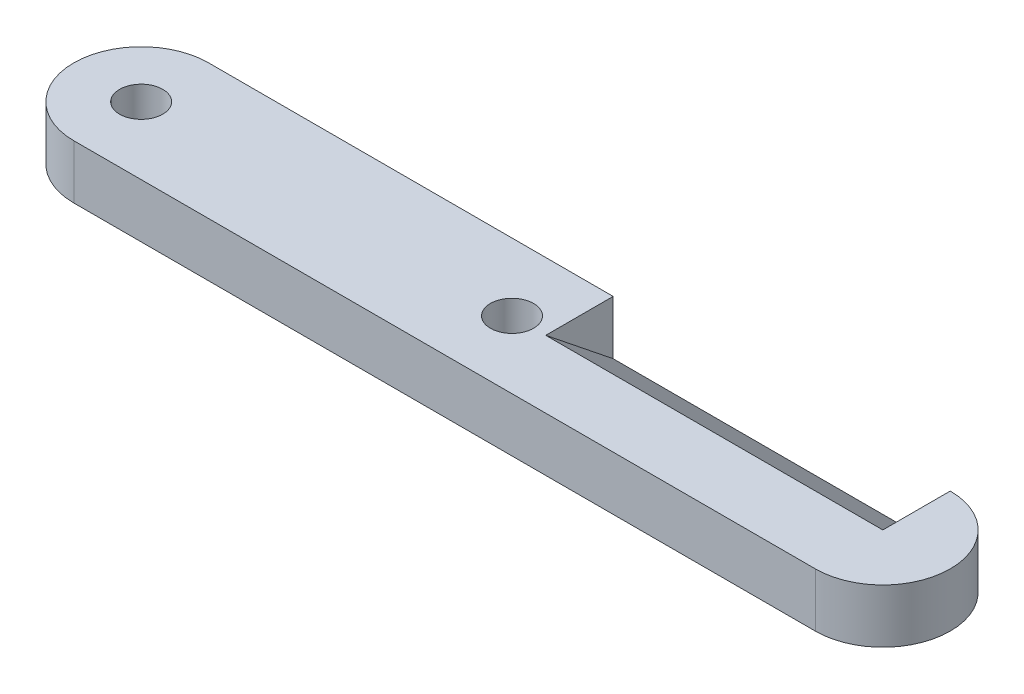
ISO-10303-21;
HEADER;
FILE_DESCRIPTION(('STEP AP214'),'2;1');
FILE_NAME('part.step','',(''),(''),'','','');
FILE_SCHEMA(('AUTOMOTIVE_DESIGN { 1 0 10303 214 1 1 1 1 }'));
ENDSEC;
DATA;
#1=APPLICATION_CONTEXT('core data for automotive mechanical design processes');
#2=APPLICATION_PROTOCOL_DEFINITION('international standard','automotive_design',2000,#1);
#3=PRODUCT_CONTEXT('',#1,'mechanical');
#4=PRODUCT('Part','Part','',(#3));
#5=PRODUCT_RELATED_PRODUCT_CATEGORY('part','',(#4));
#6=PRODUCT_DEFINITION_FORMATION('','',#4);
#7=PRODUCT_DEFINITION_CONTEXT('part definition',#1,'design');
#8=PRODUCT_DEFINITION('design','',#6,#7);
#9=PRODUCT_DEFINITION_SHAPE('','',#8);
#10=(LENGTH_UNIT() NAMED_UNIT(*) SI_UNIT(.MILLI.,.METRE.));
#11=(NAMED_UNIT(*) PLANE_ANGLE_UNIT() SI_UNIT($,.RADIAN.));
#12=(NAMED_UNIT(*) SI_UNIT($,.STERADIAN.) SOLID_ANGLE_UNIT());
#13=UNCERTAINTY_MEASURE_WITH_UNIT(LENGTH_MEASURE(1.E-05),#10,'distance_accuracy_value','');
#14=(GEOMETRIC_REPRESENTATION_CONTEXT(3) GLOBAL_UNCERTAINTY_ASSIGNED_CONTEXT((#13)) GLOBAL_UNIT_ASSIGNED_CONTEXT((#10,
#11,#12)) REPRESENTATION_CONTEXT('',''));
#15=CARTESIAN_POINT('',(0.,0.,0.));
#16=DIRECTION('',(0.,0.,1.));
#17=DIRECTION('',(1.,0.,0.));
#18=AXIS2_PLACEMENT_3D('',#15,#16,#17);
#19=CARTESIAN_POINT('',(55.,4.,0.));
#20=DIRECTION('',(1.,0.,0.));
#21=DIRECTION('',(0.,0.,-1.));
#22=AXIS2_PLACEMENT_3D('',#19,#20,#21);
#23=PLANE('',#22);
#24=DIRECTION('',(0.,-0.624695047554424,-0.78086880944303));
#25=VECTOR('',#24,1.);
#26=CARTESIAN_POINT('',(55.,4.,0.));
#27=LINE('',#26,#25);
#28=CARTESIAN_POINT('',(55.,4.,0.));
#29=VERTEX_POINT('',#28);
#30=CARTESIAN_POINT('',(55.,0.,-5.));
#31=VERTEX_POINT('',#30);
#32=EDGE_CURVE('E127',#29,#31,#27,.T.);
#33=ORIENTED_EDGE('',*,*,#32,.F.);
#34=DIRECTION('',(0.,0.,-1.));
#35=VECTOR('',#34,1.);
#36=CARTESIAN_POINT('',(55.,4.,0.));
#37=LINE('',#36,#35);
#38=CARTESIAN_POINT('',(55.,4.,-5.));
#39=VERTEX_POINT('',#38);
#40=EDGE_CURVE('E106',#29,#39,#37,.T.);
#41=ORIENTED_EDGE('',*,*,#40,.T.);
#42=DIRECTION('',(0.,-1.,0.));
#43=VECTOR('',#42,1.);
#44=CARTESIAN_POINT('',(55.,4.,-5.));
#45=LINE('',#44,#43);
#46=EDGE_CURVE('E174',#39,#31,#45,.T.);
#47=ORIENTED_EDGE('',*,*,#46,.T.);
#48=EDGE_LOOP('',(#33,#41,#47));
#49=FACE_BOUND('',#48,.T.);
#50=ADVANCED_FACE('F39',(#49),#23,.F.);
#51=CARTESIAN_POINT('',(30.,4.,0.));
#52=DIRECTION('',(-1.,0.,0.));
#53=DIRECTION('',(0.,0.,1.));
#54=AXIS2_PLACEMENT_3D('',#51,#52,#53);
#55=PLANE('',#54);
#56=DIRECTION('',(0.,-0.624695047554424,-0.78086880944303));
#57=VECTOR('',#56,1.);
#58=CARTESIAN_POINT('',(30.,4.,0.));
#59=LINE('',#58,#57);
#60=CARTESIAN_POINT('',(30.,4.,0.));
#61=VERTEX_POINT('',#60);
#62=CARTESIAN_POINT('',(30.,0.,-5.));
#63=VERTEX_POINT('',#62);
#64=EDGE_CURVE('E103',#61,#63,#59,.T.);
#65=ORIENTED_EDGE('',*,*,#64,.T.);
#66=DIRECTION('',(0.,1.,0.));
#67=VECTOR('',#66,1.);
#68=CARTESIAN_POINT('',(30.,4.,-5.));
#69=LINE('',#68,#67);
#70=CARTESIAN_POINT('',(30.,4.,-5.));
#71=VERTEX_POINT('',#70);
#72=EDGE_CURVE('E104',#63,#71,#69,.T.);
#73=ORIENTED_EDGE('',*,*,#72,.T.);
#74=DIRECTION('',(0.,0.,-1.));
#75=VECTOR('',#74,1.);
#76=CARTESIAN_POINT('',(30.,4.,0.));
#77=LINE('',#76,#75);
#78=EDGE_CURVE('E99',#61,#71,#77,.T.);
#79=ORIENTED_EDGE('',*,*,#78,.F.);
#80=EDGE_LOOP('',(#65,#73,#79));
#81=FACE_BOUND('',#80,.T.);
#82=ADVANCED_FACE('F101',(#81),#55,.F.);
#83=CARTESIAN_POINT('',(0.,4.,0.));
#84=DIRECTION('',(0.,-1.,0.));
#85=DIRECTION('',(0.,0.,-1.));
#86=AXIS2_PLACEMENT_3D('',#83,#84,#85);
#87=CYLINDRICAL_SURFACE('',#86,5.);
#88=CARTESIAN_POINT('',(0.,0.,0.));
#89=DIRECTION('',(0.,1.,0.));
#90=DIRECTION('',(0.,0.,1.));
#91=AXIS2_PLACEMENT_3D('',#88,#89,#90);
#92=CIRCLE('',#91,5.);
#93=CARTESIAN_POINT('',(0.,0.,-5.));
#94=VERTEX_POINT('',#93);
#95=CARTESIAN_POINT('',(0.,0.,5.));
#96=VERTEX_POINT('',#95);
#97=EDGE_CURVE('E138',#94,#96,#92,.T.);
#98=ORIENTED_EDGE('',*,*,#97,.T.);
#99=DIRECTION('',(0.,-1.,0.));
#100=VECTOR('',#99,1.);
#101=CARTESIAN_POINT('',(0.,4.,5.));
#102=LINE('',#101,#100);
#103=CARTESIAN_POINT('',(0.,4.,5.));
#104=VERTEX_POINT('',#103);
#105=EDGE_CURVE('E11',#104,#96,#102,.T.);
#106=ORIENTED_EDGE('',*,*,#105,.F.);
#107=CARTESIAN_POINT('',(0.,4.,0.));
#108=DIRECTION('',(0.,1.,0.));
#109=DIRECTION('',(0.,0.,1.));
#110=AXIS2_PLACEMENT_3D('',#107,#108,#109);
#111=CIRCLE('',#110,5.);
#112=CARTESIAN_POINT('',(0.,4.,-5.));
#113=VERTEX_POINT('',#112);
#114=EDGE_CURVE('E150',#113,#104,#111,.T.);
#115=ORIENTED_EDGE('',*,*,#114,.F.);
#116=DIRECTION('',(0.,-1.,0.));
#117=VECTOR('',#116,1.);
#118=CARTESIAN_POINT('',(0.,4.,-5.));
#119=LINE('',#118,#117);
#120=EDGE_CURVE('E160',#113,#94,#119,.T.);
#121=ORIENTED_EDGE('',*,*,#120,.T.);
#122=EDGE_LOOP('',(#98,#106,#115,#121));
#123=FACE_BOUND('',#122,.T.);
#124=ADVANCED_FACE('F41',(#123),#87,.T.);
#125=CARTESIAN_POINT('',(0.,4.,5.));
#126=DIRECTION('',(0.,0.,-1.));
#127=DIRECTION('',(-1.,0.,0.));
#128=AXIS2_PLACEMENT_3D('',#125,#126,#127);
#129=PLANE('',#128);
#130=DIRECTION('',(1.,0.,0.));
#131=VECTOR('',#130,1.);
#132=CARTESIAN_POINT('',(0.,0.,5.));
#133=LINE('',#132,#131);
#134=CARTESIAN_POINT('',(55.,0.,5.));
#135=VERTEX_POINT('',#134);
#136=EDGE_CURVE('E71',#96,#135,#133,.T.);
#137=ORIENTED_EDGE('',*,*,#136,.T.);
#138=DIRECTION('',(0.,-1.,0.));
#139=VECTOR('',#138,1.);
#140=CARTESIAN_POINT('',(55.,4.,5.));
#141=LINE('',#140,#139);
#142=CARTESIAN_POINT('',(55.,4.,5.));
#143=VERTEX_POINT('',#142);
#144=EDGE_CURVE('E49',#143,#135,#141,.T.);
#145=ORIENTED_EDGE('',*,*,#144,.F.);
#146=DIRECTION('',(1.,0.,0.));
#147=VECTOR('',#146,1.);
#148=CARTESIAN_POINT('',(0.,4.,5.));
#149=LINE('',#148,#147);
#150=EDGE_CURVE('E80',#104,#143,#149,.T.);
#151=ORIENTED_EDGE('',*,*,#150,.F.);
#152=ORIENTED_EDGE('',*,*,#105,.T.);
#153=EDGE_LOOP('',(#137,#145,#151,#152));
#154=FACE_BOUND('',#153,.T.);
#155=ADVANCED_FACE('F191',(#154),#129,.F.);
#156=CARTESIAN_POINT('',(55.,4.,0.));
#157=DIRECTION('',(0.,-1.,0.));
#158=DIRECTION('',(0.,0.,-1.));
#159=AXIS2_PLACEMENT_3D('',#156,#157,#158);
#160=CYLINDRICAL_SURFACE('',#159,5.);
#161=CARTESIAN_POINT('',(55.,0.,0.));
#162=DIRECTION('',(0.,1.,0.));
#163=DIRECTION('',(0.,0.,1.));
#164=AXIS2_PLACEMENT_3D('',#161,#162,#163);
#165=CIRCLE('',#164,5.);
#166=EDGE_CURVE('E166',#135,#31,#165,.T.);
#167=ORIENTED_EDGE('',*,*,#166,.T.);
#168=ORIENTED_EDGE('',*,*,#46,.F.);
#169=CARTESIAN_POINT('',(55.,4.,0.));
#170=DIRECTION('',(0.,1.,0.));
#171=DIRECTION('',(0.,0.,1.));
#172=AXIS2_PLACEMENT_3D('',#169,#170,#171);
#173=CIRCLE('',#172,5.);
#174=EDGE_CURVE('E155',#143,#39,#173,.T.);
#175=ORIENTED_EDGE('',*,*,#174,.F.);
#176=ORIENTED_EDGE('',*,*,#144,.T.);
#177=EDGE_LOOP('',(#167,#168,#175,#176));
#178=FACE_BOUND('',#177,.T.);
#179=ADVANCED_FACE('F180',(#178),#160,.T.);
#180=CARTESIAN_POINT('',(0.,4.,-5.));
#181=DIRECTION('',(0.,0.,1.));
#182=DIRECTION('',(1.,0.,0.));
#183=AXIS2_PLACEMENT_3D('',#180,#181,#182);
#184=PLANE('',#183);
#185=DIRECTION('',(-1.,0.,0.));
#186=VECTOR('',#185,1.);
#187=CARTESIAN_POINT('',(0.,4.,-5.));
#188=LINE('',#187,#186);
#189=EDGE_CURVE('E57',#71,#113,#188,.T.);
#190=ORIENTED_EDGE('',*,*,#189,.F.);
#191=ORIENTED_EDGE('',*,*,#72,.F.);
#192=DIRECTION('',(-1.,0.,0.));
#193=VECTOR('',#192,1.);
#194=CARTESIAN_POINT('',(0.,0.,-5.));
#195=LINE('',#194,#193);
#196=EDGE_CURVE('E77',#63,#94,#195,.T.);
#197=ORIENTED_EDGE('',*,*,#196,.T.);
#198=ORIENTED_EDGE('',*,*,#120,.F.);
#199=EDGE_LOOP('',(#190,#191,#197,#198));
#200=FACE_BOUND('',#199,.T.);
#201=ADVANCED_FACE('F197',(#200),#184,.F.);
#202=CARTESIAN_POINT('',(0.,4.,0.));
#203=DIRECTION('',(0.,1.,0.));
#204=DIRECTION('',(0.,0.,1.));
#205=AXIS2_PLACEMENT_3D('',#202,#203,#204);
#206=PLANE('',#205);
#207=ORIENTED_EDGE('',*,*,#40,.F.);
#208=DIRECTION('',(1.,0.,0.));
#209=VECTOR('',#208,1.);
#210=CARTESIAN_POINT('',(55.,4.,0.));
#211=LINE('',#210,#209);
#212=EDGE_CURVE('E107',#61,#29,#211,.T.);
#213=ORIENTED_EDGE('',*,*,#212,.F.);
#214=ORIENTED_EDGE('',*,*,#78,.T.);
#215=ORIENTED_EDGE('',*,*,#189,.T.);
#216=ORIENTED_EDGE('',*,*,#114,.T.);
#217=ORIENTED_EDGE('',*,*,#150,.T.);
#218=ORIENTED_EDGE('',*,*,#174,.T.);
#219=EDGE_LOOP('',(#207,#213,#214,#215,#216,#217,#218));
#220=FACE_BOUND('',#219,.T.);
#221=CARTESIAN_POINT('',(0.,4.,0.));
#222=DIRECTION('',(0.,1.,0.));
#223=DIRECTION('',(0.,0.,1.));
#224=AXIS2_PLACEMENT_3D('',#221,#222,#223);
#225=CIRCLE('',#224,1.6);
#226=CARTESIAN_POINT('',(0.,4.,1.6));
#227=VERTEX_POINT('',#226);
#228=EDGE_CURVE('E139',#227,#227,#225,.T.);
#229=ORIENTED_EDGE('',*,*,#228,.F.);
#230=EDGE_LOOP('',(#229));
#231=FACE_BOUND('',#230,.T.);
#232=CARTESIAN_POINT('',(27.5,4.,0.));
#233=DIRECTION('',(0.,1.,0.));
#234=DIRECTION('',(0.,0.,1.));
#235=AXIS2_PLACEMENT_3D('',#232,#233,#234);
#236=CIRCLE('',#235,1.6);
#237=CARTESIAN_POINT('',(27.5,4.,1.6));
#238=VERTEX_POINT('',#237);
#239=EDGE_CURVE('E132',#238,#238,#236,.T.);
#240=ORIENTED_EDGE('',*,*,#239,.F.);
#241=EDGE_LOOP('',(#240));
#242=FACE_BOUND('',#241,.T.);
#243=ADVANCED_FACE('F111',(#220,#231,#242),#206,.T.);
#244=CARTESIAN_POINT('',(0.,0.,0.));
#245=DIRECTION('',(0.,1.,0.));
#246=DIRECTION('',(0.,0.,1.));
#247=AXIS2_PLACEMENT_3D('',#244,#245,#246);
#248=PLANE('',#247);
#249=DIRECTION('',(1.,0.,0.));
#250=VECTOR('',#249,1.);
#251=CARTESIAN_POINT('',(23.5968757625672,0.,-5.));
#252=LINE('',#251,#250);
#253=EDGE_CURVE('E121',#63,#31,#252,.T.);
#254=ORIENTED_EDGE('',*,*,#253,.T.);
#255=ORIENTED_EDGE('',*,*,#166,.F.);
#256=ORIENTED_EDGE('',*,*,#136,.F.);
#257=ORIENTED_EDGE('',*,*,#97,.F.);
#258=ORIENTED_EDGE('',*,*,#196,.F.);
#259=EDGE_LOOP('',(#254,#255,#256,#257,#258));
#260=FACE_BOUND('',#259,.T.);
#261=CARTESIAN_POINT('',(0.,0.,0.));
#262=DIRECTION('',(0.,1.,0.));
#263=DIRECTION('',(0.,0.,1.));
#264=AXIS2_PLACEMENT_3D('',#261,#262,#263);
#265=CIRCLE('',#264,1.6);
#266=CARTESIAN_POINT('',(0.,0.,1.6));
#267=VERTEX_POINT('',#266);
#268=EDGE_CURVE('E134',#267,#267,#265,.T.);
#269=ORIENTED_EDGE('',*,*,#268,.T.);
#270=EDGE_LOOP('',(#269));
#271=FACE_BOUND('',#270,.T.);
#272=CARTESIAN_POINT('',(27.5,0.,0.));
#273=DIRECTION('',(0.,1.,0.));
#274=DIRECTION('',(0.,0.,1.));
#275=AXIS2_PLACEMENT_3D('',#272,#273,#274);
#276=CIRCLE('',#275,1.6);
#277=CARTESIAN_POINT('',(27.5,0.,1.6));
#278=VERTEX_POINT('',#277);
#279=EDGE_CURVE('E143',#278,#278,#276,.T.);
#280=ORIENTED_EDGE('',*,*,#279,.T.);
#281=EDGE_LOOP('',(#280));
#282=FACE_BOUND('',#281,.T.);
#283=ADVANCED_FACE('F183',(#260,#271,#282),#248,.F.);
#284=CARTESIAN_POINT('',(27.5,0.,0.));
#285=DIRECTION('',(0.,1.,0.));
#286=DIRECTION('',(0.,0.,1.));
#287=AXIS2_PLACEMENT_3D('',#284,#285,#286);
#288=CYLINDRICAL_SURFACE('',#287,1.6);
#289=ORIENTED_EDGE('',*,*,#279,.F.);
#290=EDGE_LOOP('',(#289));
#291=FACE_BOUND('',#290,.T.);
#292=ORIENTED_EDGE('',*,*,#239,.T.);
#293=EDGE_LOOP('',(#292));
#294=FACE_BOUND('',#293,.T.);
#295=ADVANCED_FACE('F210',(#291,#294),#288,.F.);
#296=CARTESIAN_POINT('',(0.,0.,0.));
#297=DIRECTION('',(0.,1.,0.));
#298=DIRECTION('',(0.,0.,1.));
#299=AXIS2_PLACEMENT_3D('',#296,#297,#298);
#300=CYLINDRICAL_SURFACE('',#299,1.6);
#301=ORIENTED_EDGE('',*,*,#268,.F.);
#302=EDGE_LOOP('',(#301));
#303=FACE_BOUND('',#302,.T.);
#304=ORIENTED_EDGE('',*,*,#228,.T.);
#305=EDGE_LOOP('',(#304));
#306=FACE_BOUND('',#305,.T.);
#307=ADVANCED_FACE('F207',(#303,#306),#300,.F.);
#308=CARTESIAN_POINT('',(23.5968757625672,4.,0.));
#309=DIRECTION('',(0.,-0.78086880944303,0.624695047554424));
#310=DIRECTION('',(0.,-0.624695047554424,-0.78086880944303));
#311=AXIS2_PLACEMENT_3D('',#308,#309,#310);
#312=PLANE('',#311);
#313=ORIENTED_EDGE('',*,*,#64,.F.);
#314=ORIENTED_EDGE('',*,*,#212,.T.);
#315=ORIENTED_EDGE('',*,*,#32,.T.);
#316=ORIENTED_EDGE('',*,*,#253,.F.);
#317=EDGE_LOOP('',(#313,#314,#315,#316));
#318=FACE_BOUND('',#317,.T.);
#319=ADVANCED_FACE('F119',(#318),#312,.F.);
#320=CLOSED_SHELL('',(#50,#82,#124,#155,#179,#201,#243,#283,#295,#307,#319));
#321=MANIFOLD_SOLID_BREP('B2',#320);
#322=ADVANCED_BREP_SHAPE_REPRESENTATION('',(#18,#321),#14);
#323=SHAPE_DEFINITION_REPRESENTATION(#9,#322);
ENDSEC;
END-ISO-10303-21;
